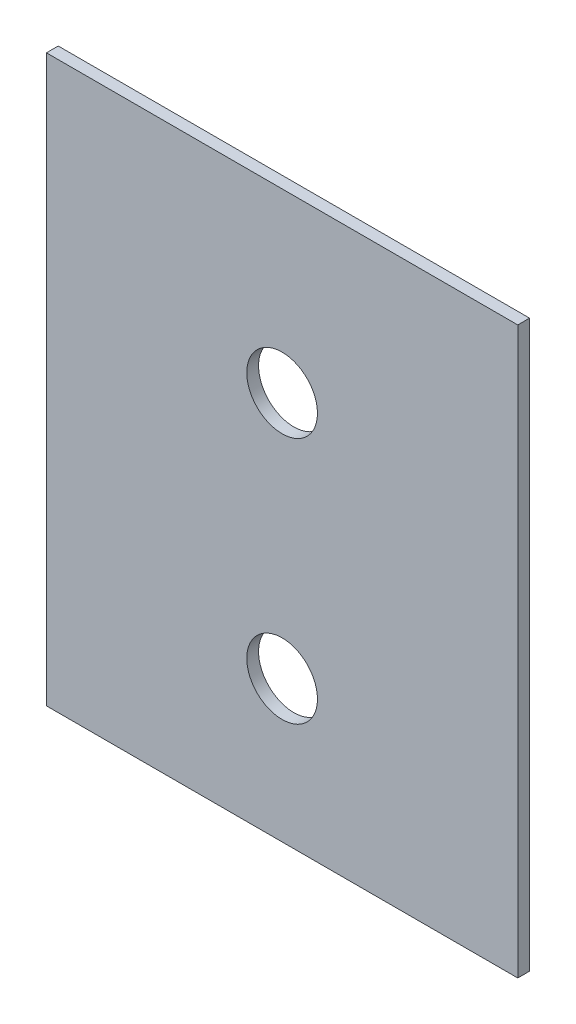
ISO-10303-21;
HEADER;
FILE_DESCRIPTION(('STEP AP214'),'2;1');
FILE_NAME('part.step','',(''),(''),'','','');
FILE_SCHEMA(('AUTOMOTIVE_DESIGN { 1 0 10303 214 1 1 1 1 }'));
ENDSEC;
DATA;
#1=APPLICATION_CONTEXT('core data for automotive mechanical design processes');
#2=APPLICATION_PROTOCOL_DEFINITION('international standard','automotive_design',2000,#1);
#3=PRODUCT_CONTEXT('',#1,'mechanical');
#4=PRODUCT('Part','Part','',(#3));
#5=PRODUCT_RELATED_PRODUCT_CATEGORY('part','',(#4));
#6=PRODUCT_DEFINITION_FORMATION('','',#4);
#7=PRODUCT_DEFINITION_CONTEXT('part definition',#1,'design');
#8=PRODUCT_DEFINITION('design','',#6,#7);
#9=PRODUCT_DEFINITION_SHAPE('','',#8);
#10=(LENGTH_UNIT() NAMED_UNIT(*) SI_UNIT(.MILLI.,.METRE.));
#11=(NAMED_UNIT(*) PLANE_ANGLE_UNIT() SI_UNIT($,.RADIAN.));
#12=(NAMED_UNIT(*) SI_UNIT($,.STERADIAN.) SOLID_ANGLE_UNIT());
#13=UNCERTAINTY_MEASURE_WITH_UNIT(LENGTH_MEASURE(1.E-05),#10,'distance_accuracy_value','');
#14=(GEOMETRIC_REPRESENTATION_CONTEXT(3) GLOBAL_UNCERTAINTY_ASSIGNED_CONTEXT((#13)) GLOBAL_UNIT_ASSIGNED_CONTEXT((#10,
#11,#12)) REPRESENTATION_CONTEXT('',''));
#15=CARTESIAN_POINT('',(0.,0.,0.));
#16=DIRECTION('',(0.,0.,1.));
#17=DIRECTION('',(1.,0.,0.));
#18=AXIS2_PLACEMENT_3D('',#15,#16,#17);
#19=CARTESIAN_POINT('',(0.,480.,10.));
#20=DIRECTION('',(0.,0.,-1.));
#21=DIRECTION('',(-1.,0.,0.));
#22=AXIS2_PLACEMENT_3D('',#19,#20,#21);
#23=PLANE('',#22);
#24=CARTESIAN_POINT('',(200.,330.,10.));
#25=DIRECTION('',(0.,0.,1.));
#26=DIRECTION('',(1.,0.,0.));
#27=AXIS2_PLACEMENT_3D('',#24,#25,#26);
#28=CIRCLE('',#27,30.);
#29=CARTESIAN_POINT('',(230.,330.,10.));
#30=VERTEX_POINT('',#29);
#31=EDGE_CURVE('E98',#30,#30,#28,.T.);
#32=ORIENTED_EDGE('',*,*,#31,.F.);
#33=EDGE_LOOP('',(#32));
#34=FACE_BOUND('',#33,.T.);
#35=DIRECTION('',(0.,-1.,0.));
#36=VECTOR('',#35,1.);
#37=CARTESIAN_POINT('',(0.,0.,10.));
#38=LINE('',#37,#36);
#39=CARTESIAN_POINT('',(0.,480.,10.));
#40=VERTEX_POINT('',#39);
#41=CARTESIAN_POINT('',(0.,0.,10.));
#42=VERTEX_POINT('',#41);
#43=EDGE_CURVE('E83',#40,#42,#38,.T.);
#44=ORIENTED_EDGE('',*,*,#43,.T.);
#45=DIRECTION('',(1.,0.,0.));
#46=VECTOR('',#45,1.);
#47=CARTESIAN_POINT('',(0.,0.,10.));
#48=LINE('',#47,#46);
#49=CARTESIAN_POINT('',(400.,0.,10.));
#50=VERTEX_POINT('',#49);
#51=EDGE_CURVE('E78',#42,#50,#48,.T.);
#52=ORIENTED_EDGE('',*,*,#51,.T.);
#53=DIRECTION('',(0.,1.,0.));
#54=VECTOR('',#53,1.);
#55=CARTESIAN_POINT('',(400.,0.,10.));
#56=LINE('',#55,#54);
#57=CARTESIAN_POINT('',(400.,480.,10.));
#58=VERTEX_POINT('',#57);
#59=EDGE_CURVE('E81',#50,#58,#56,.T.);
#60=ORIENTED_EDGE('',*,*,#59,.T.);
#61=DIRECTION('',(-1.,0.,0.));
#62=VECTOR('',#61,1.);
#63=CARTESIAN_POINT('',(0.,480.,10.));
#64=LINE('',#63,#62);
#65=EDGE_CURVE('E48',#58,#40,#64,.T.);
#66=ORIENTED_EDGE('',*,*,#65,.T.);
#67=EDGE_LOOP('',(#44,#52,#60,#66));
#68=FACE_BOUND('',#67,.T.);
#69=CARTESIAN_POINT('',(200.,120.,10.));
#70=DIRECTION('',(0.,0.,1.));
#71=DIRECTION('',(1.,0.,0.));
#72=AXIS2_PLACEMENT_3D('',#69,#70,#71);
#73=CIRCLE('',#72,30.0000000000001);
#74=CARTESIAN_POINT('',(230.,120.,10.));
#75=VERTEX_POINT('',#74);
#76=EDGE_CURVE('E113',#75,#75,#73,.T.);
#77=ORIENTED_EDGE('',*,*,#76,.F.);
#78=EDGE_LOOP('',(#77));
#79=FACE_BOUND('',#78,.T.);
#80=ADVANCED_FACE('F31',(#34,#68,#79),#23,.F.);
#81=CARTESIAN_POINT('',(0.,480.,0.));
#82=DIRECTION('',(0.,0.,-1.));
#83=DIRECTION('',(-1.,0.,0.));
#84=AXIS2_PLACEMENT_3D('',#81,#82,#83);
#85=PLANE('',#84);
#86=CARTESIAN_POINT('',(200.,330.,0.));
#87=DIRECTION('',(0.,0.,1.));
#88=DIRECTION('',(1.,0.,0.));
#89=AXIS2_PLACEMENT_3D('',#86,#87,#88);
#90=CIRCLE('',#89,30.);
#91=CARTESIAN_POINT('',(230.,330.,0.));
#92=VERTEX_POINT('',#91);
#93=EDGE_CURVE('E110',#92,#92,#90,.T.);
#94=ORIENTED_EDGE('',*,*,#93,.T.);
#95=EDGE_LOOP('',(#94));
#96=FACE_BOUND('',#95,.T.);
#97=DIRECTION('',(0.,-1.,0.));
#98=VECTOR('',#97,1.);
#99=CARTESIAN_POINT('',(0.,0.,0.));
#100=LINE('',#99,#98);
#101=CARTESIAN_POINT('',(0.,480.,0.));
#102=VERTEX_POINT('',#101);
#103=CARTESIAN_POINT('',(0.,0.,0.));
#104=VERTEX_POINT('',#103);
#105=EDGE_CURVE('E95',#102,#104,#100,.T.);
#106=ORIENTED_EDGE('',*,*,#105,.F.);
#107=DIRECTION('',(-1.,0.,0.));
#108=VECTOR('',#107,1.);
#109=CARTESIAN_POINT('',(0.,480.,0.));
#110=LINE('',#109,#108);
#111=CARTESIAN_POINT('',(400.,480.,0.));
#112=VERTEX_POINT('',#111);
#113=EDGE_CURVE('E71',#112,#102,#110,.T.);
#114=ORIENTED_EDGE('',*,*,#113,.F.);
#115=DIRECTION('',(0.,1.,0.));
#116=VECTOR('',#115,1.);
#117=CARTESIAN_POINT('',(400.,0.,0.));
#118=LINE('',#117,#116);
#119=CARTESIAN_POINT('',(400.,0.,0.));
#120=VERTEX_POINT('',#119);
#121=EDGE_CURVE('E65',#120,#112,#118,.T.);
#122=ORIENTED_EDGE('',*,*,#121,.F.);
#123=DIRECTION('',(1.,0.,0.));
#124=VECTOR('',#123,1.);
#125=CARTESIAN_POINT('',(0.,0.,0.));
#126=LINE('',#125,#124);
#127=EDGE_CURVE('E87',#104,#120,#126,.T.);
#128=ORIENTED_EDGE('',*,*,#127,.F.);
#129=EDGE_LOOP('',(#106,#114,#122,#128));
#130=FACE_BOUND('',#129,.T.);
#131=CARTESIAN_POINT('',(200.,120.,0.));
#132=DIRECTION('',(0.,0.,1.));
#133=DIRECTION('',(1.,0.,0.));
#134=AXIS2_PLACEMENT_3D('',#131,#132,#133);
#135=CIRCLE('',#134,30.0000000000001);
#136=CARTESIAN_POINT('',(230.,120.,0.));
#137=VERTEX_POINT('',#136);
#138=EDGE_CURVE('E116',#137,#137,#135,.T.);
#139=ORIENTED_EDGE('',*,*,#138,.T.);
#140=EDGE_LOOP('',(#139));
#141=FACE_BOUND('',#140,.T.);
#142=ADVANCED_FACE('F106',(#96,#130,#141),#85,.T.);
#143=CARTESIAN_POINT('',(0.,0.,10.));
#144=DIRECTION('',(1.,0.,0.));
#145=DIRECTION('',(0.,0.,-1.));
#146=AXIS2_PLACEMENT_3D('',#143,#144,#145);
#147=PLANE('',#146);
#148=ORIENTED_EDGE('',*,*,#105,.T.);
#149=DIRECTION('',(0.,0.,-1.));
#150=VECTOR('',#149,1.);
#151=CARTESIAN_POINT('',(0.,0.,10.));
#152=LINE('',#151,#150);
#153=EDGE_CURVE('E11',#42,#104,#152,.T.);
#154=ORIENTED_EDGE('',*,*,#153,.F.);
#155=ORIENTED_EDGE('',*,*,#43,.F.);
#156=DIRECTION('',(0.,0.,-1.));
#157=VECTOR('',#156,1.);
#158=CARTESIAN_POINT('',(0.,480.,10.));
#159=LINE('',#158,#157);
#160=EDGE_CURVE('E91',#40,#102,#159,.T.);
#161=ORIENTED_EDGE('',*,*,#160,.T.);
#162=EDGE_LOOP('',(#148,#154,#155,#161));
#163=FACE_BOUND('',#162,.T.);
#164=ADVANCED_FACE('F33',(#163),#147,.F.);
#165=CARTESIAN_POINT('',(0.,0.,10.));
#166=DIRECTION('',(0.,1.,0.));
#167=DIRECTION('',(0.,0.,1.));
#168=AXIS2_PLACEMENT_3D('',#165,#166,#167);
#169=PLANE('',#168);
#170=ORIENTED_EDGE('',*,*,#127,.T.);
#171=DIRECTION('',(0.,0.,-1.));
#172=VECTOR('',#171,1.);
#173=CARTESIAN_POINT('',(400.,0.,10.));
#174=LINE('',#173,#172);
#175=EDGE_CURVE('E40',#50,#120,#174,.T.);
#176=ORIENTED_EDGE('',*,*,#175,.F.);
#177=ORIENTED_EDGE('',*,*,#51,.F.);
#178=ORIENTED_EDGE('',*,*,#153,.T.);
#179=EDGE_LOOP('',(#170,#176,#177,#178));
#180=FACE_BOUND('',#179,.T.);
#181=ADVANCED_FACE('F86',(#180),#169,.F.);
#182=CARTESIAN_POINT('',(400.,0.,10.));
#183=DIRECTION('',(-1.,0.,0.));
#184=DIRECTION('',(0.,0.,1.));
#185=AXIS2_PLACEMENT_3D('',#182,#183,#184);
#186=PLANE('',#185);
#187=ORIENTED_EDGE('',*,*,#121,.T.);
#188=DIRECTION('',(0.,0.,-1.));
#189=VECTOR('',#188,1.);
#190=CARTESIAN_POINT('',(400.,480.,10.));
#191=LINE('',#190,#189);
#192=EDGE_CURVE('E88',#58,#112,#191,.T.);
#193=ORIENTED_EDGE('',*,*,#192,.F.);
#194=ORIENTED_EDGE('',*,*,#59,.F.);
#195=ORIENTED_EDGE('',*,*,#175,.T.);
#196=EDGE_LOOP('',(#187,#193,#194,#195));
#197=FACE_BOUND('',#196,.T.);
#198=ADVANCED_FACE('F89',(#197),#186,.F.);
#199=CARTESIAN_POINT('',(0.,480.,10.));
#200=DIRECTION('',(0.,-1.,0.));
#201=DIRECTION('',(0.,0.,-1.));
#202=AXIS2_PLACEMENT_3D('',#199,#200,#201);
#203=PLANE('',#202);
#204=ORIENTED_EDGE('',*,*,#113,.T.);
#205=ORIENTED_EDGE('',*,*,#160,.F.);
#206=ORIENTED_EDGE('',*,*,#65,.F.);
#207=ORIENTED_EDGE('',*,*,#192,.T.);
#208=EDGE_LOOP('',(#204,#205,#206,#207));
#209=FACE_BOUND('',#208,.T.);
#210=ADVANCED_FACE('F103',(#209),#203,.F.);
#211=CARTESIAN_POINT('',(200.,330.,10.));
#212=DIRECTION('',(0.,0.,-1.));
#213=DIRECTION('',(-1.,0.,0.));
#214=AXIS2_PLACEMENT_3D('',#211,#212,#213);
#215=CYLINDRICAL_SURFACE('',#214,30.);
#216=ORIENTED_EDGE('',*,*,#31,.T.);
#217=EDGE_LOOP('',(#216));
#218=FACE_BOUND('',#217,.T.);
#219=ORIENTED_EDGE('',*,*,#93,.F.);
#220=EDGE_LOOP('',(#219));
#221=FACE_BOUND('',#220,.T.);
#222=ADVANCED_FACE('F134',(#218,#221),#215,.F.);
#223=CARTESIAN_POINT('',(200.,120.,10.));
#224=DIRECTION('',(0.,0.,-1.));
#225=DIRECTION('',(-1.,0.,0.));
#226=AXIS2_PLACEMENT_3D('',#223,#224,#225);
#227=CYLINDRICAL_SURFACE('',#226,30.0000000000001);
#228=ORIENTED_EDGE('',*,*,#76,.T.);
#229=EDGE_LOOP('',(#228));
#230=FACE_BOUND('',#229,.T.);
#231=ORIENTED_EDGE('',*,*,#138,.F.);
#232=EDGE_LOOP('',(#231));
#233=FACE_BOUND('',#232,.T.);
#234=ADVANCED_FACE('F122',(#230,#233),#227,.F.);
#235=CLOSED_SHELL('',(#80,#142,#164,#181,#198,#210,#222,#234));
#236=MANIFOLD_SOLID_BREP('B2',#235);
#237=ADVANCED_BREP_SHAPE_REPRESENTATION('',(#18,#236),#14);
#238=SHAPE_DEFINITION_REPRESENTATION(#9,#237);
ENDSEC;
END-ISO-10303-21;
